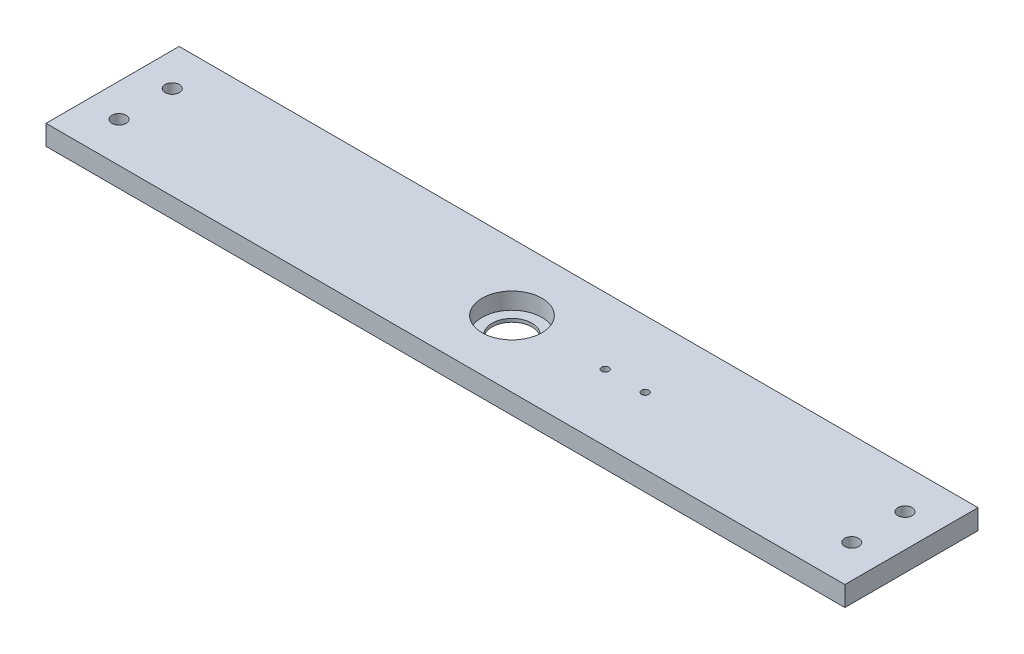
ISO-10303-21;
HEADER;
FILE_DESCRIPTION(('STEP AP214'),'2;1');
FILE_NAME('part.step','',(''),(''),'','','');
FILE_SCHEMA(('AUTOMOTIVE_DESIGN { 1 0 10303 214 1 1 1 1 }'));
ENDSEC;
DATA;
#1=APPLICATION_CONTEXT('core data for automotive mechanical design processes');
#2=APPLICATION_PROTOCOL_DEFINITION('international standard','automotive_design',2000,#1);
#3=PRODUCT_CONTEXT('',#1,'mechanical');
#4=PRODUCT('Part','Part','',(#3));
#5=PRODUCT_RELATED_PRODUCT_CATEGORY('part','',(#4));
#6=PRODUCT_DEFINITION_FORMATION('','',#4);
#7=PRODUCT_DEFINITION_CONTEXT('part definition',#1,'design');
#8=PRODUCT_DEFINITION('design','',#6,#7);
#9=PRODUCT_DEFINITION_SHAPE('','',#8);
#10=(LENGTH_UNIT() NAMED_UNIT(*) SI_UNIT(.MILLI.,.METRE.));
#11=(NAMED_UNIT(*) PLANE_ANGLE_UNIT() SI_UNIT($,.RADIAN.));
#12=(NAMED_UNIT(*) SI_UNIT($,.STERADIAN.) SOLID_ANGLE_UNIT());
#13=UNCERTAINTY_MEASURE_WITH_UNIT(LENGTH_MEASURE(1.E-05),#10,'distance_accuracy_value','');
#14=(GEOMETRIC_REPRESENTATION_CONTEXT(3) GLOBAL_UNCERTAINTY_ASSIGNED_CONTEXT((#13)) GLOBAL_UNIT_ASSIGNED_CONTEXT((#10,
#11,#12)) REPRESENTATION_CONTEXT('',''));
#15=CARTESIAN_POINT('',(0.,0.,0.));
#16=DIRECTION('',(0.,0.,1.));
#17=DIRECTION('',(1.,0.,0.));
#18=AXIS2_PLACEMENT_3D('',#15,#16,#17);
#19=CARTESIAN_POINT('',(190.5,9.525,31.75));
#20=DIRECTION('',(-1.,0.,0.));
#21=DIRECTION('',(0.,0.,1.));
#22=AXIS2_PLACEMENT_3D('',#19,#20,#21);
#23=PLANE('',#22);
#24=DIRECTION('',(0.,0.,-1.));
#25=VECTOR('',#24,1.);
#26=CARTESIAN_POINT('',(190.5,0.,31.75));
#27=LINE('',#26,#25);
#28=CARTESIAN_POINT('',(190.5,0.,31.75));
#29=VERTEX_POINT('',#28);
#30=CARTESIAN_POINT('',(190.5,0.,-31.75));
#31=VERTEX_POINT('',#30);
#32=EDGE_CURVE('E100',#29,#31,#27,.T.);
#33=ORIENTED_EDGE('',*,*,#32,.T.);
#34=DIRECTION('',(0.,-1.,0.));
#35=VECTOR('',#34,1.);
#36=CARTESIAN_POINT('',(190.5,9.525,-31.75));
#37=LINE('',#36,#35);
#38=CARTESIAN_POINT('',(190.5,9.525,-31.75));
#39=VERTEX_POINT('',#38);
#40=EDGE_CURVE('E11',#39,#31,#37,.T.);
#41=ORIENTED_EDGE('',*,*,#40,.F.);
#42=DIRECTION('',(0.,0.,-1.));
#43=VECTOR('',#42,1.);
#44=CARTESIAN_POINT('',(190.5,9.525,31.75));
#45=LINE('',#44,#43);
#46=CARTESIAN_POINT('',(190.5,9.525,31.75));
#47=VERTEX_POINT('',#46);
#48=EDGE_CURVE('E88',#47,#39,#45,.T.);
#49=ORIENTED_EDGE('',*,*,#48,.F.);
#50=DIRECTION('',(0.,-1.,0.));
#51=VECTOR('',#50,1.);
#52=CARTESIAN_POINT('',(190.5,9.525,31.75));
#53=LINE('',#52,#51);
#54=EDGE_CURVE('E96',#47,#29,#53,.T.);
#55=ORIENTED_EDGE('',*,*,#54,.T.);
#56=EDGE_LOOP('',(#33,#41,#49,#55));
#57=FACE_BOUND('',#56,.T.);
#58=ADVANCED_FACE('F37',(#57),#23,.F.);
#59=CARTESIAN_POINT('',(-190.5,9.525,-31.75));
#60=DIRECTION('',(0.,0.,1.));
#61=DIRECTION('',(1.,0.,0.));
#62=AXIS2_PLACEMENT_3D('',#59,#60,#61);
#63=PLANE('',#62);
#64=DIRECTION('',(-1.,0.,0.));
#65=VECTOR('',#64,1.);
#66=CARTESIAN_POINT('',(-190.5,0.,-31.75));
#67=LINE('',#66,#65);
#68=CARTESIAN_POINT('',(-190.5,0.,-31.75));
#69=VERTEX_POINT('',#68);
#70=EDGE_CURVE('E92',#31,#69,#67,.T.);
#71=ORIENTED_EDGE('',*,*,#70,.T.);
#72=DIRECTION('',(0.,-1.,0.));
#73=VECTOR('',#72,1.);
#74=CARTESIAN_POINT('',(-190.5,9.525,-31.75));
#75=LINE('',#74,#73);
#76=CARTESIAN_POINT('',(-190.5,9.525,-31.75));
#77=VERTEX_POINT('',#76);
#78=EDGE_CURVE('E45',#77,#69,#75,.T.);
#79=ORIENTED_EDGE('',*,*,#78,.F.);
#80=DIRECTION('',(-1.,0.,0.));
#81=VECTOR('',#80,1.);
#82=CARTESIAN_POINT('',(-190.5,9.525,-31.75));
#83=LINE('',#82,#81);
#84=EDGE_CURVE('E83',#39,#77,#83,.T.);
#85=ORIENTED_EDGE('',*,*,#84,.F.);
#86=ORIENTED_EDGE('',*,*,#40,.T.);
#87=EDGE_LOOP('',(#71,#79,#85,#86));
#88=FACE_BOUND('',#87,.T.);
#89=ADVANCED_FACE('F91',(#88),#63,.F.);
#90=CARTESIAN_POINT('',(-190.5,9.525,31.75));
#91=DIRECTION('',(1.,0.,0.));
#92=DIRECTION('',(0.,0.,-1.));
#93=AXIS2_PLACEMENT_3D('',#90,#91,#92);
#94=PLANE('',#93);
#95=DIRECTION('',(0.,0.,1.));
#96=VECTOR('',#95,1.);
#97=CARTESIAN_POINT('',(-190.5,0.,31.75));
#98=LINE('',#97,#96);
#99=CARTESIAN_POINT('',(-190.5,0.,31.75));
#100=VERTEX_POINT('',#99);
#101=EDGE_CURVE('E70',#69,#100,#98,.T.);
#102=ORIENTED_EDGE('',*,*,#101,.T.);
#103=DIRECTION('',(0.,-1.,0.));
#104=VECTOR('',#103,1.);
#105=CARTESIAN_POINT('',(-190.5,9.525,31.75));
#106=LINE('',#105,#104);
#107=CARTESIAN_POINT('',(-190.5,9.525,31.75));
#108=VERTEX_POINT('',#107);
#109=EDGE_CURVE('E93',#108,#100,#106,.T.);
#110=ORIENTED_EDGE('',*,*,#109,.F.);
#111=DIRECTION('',(0.,0.,1.));
#112=VECTOR('',#111,1.);
#113=CARTESIAN_POINT('',(-190.5,9.525,31.75));
#114=LINE('',#113,#112);
#115=EDGE_CURVE('E86',#77,#108,#114,.T.);
#116=ORIENTED_EDGE('',*,*,#115,.F.);
#117=ORIENTED_EDGE('',*,*,#78,.T.);
#118=EDGE_LOOP('',(#102,#110,#116,#117));
#119=FACE_BOUND('',#118,.T.);
#120=ADVANCED_FACE('F94',(#119),#94,.F.);
#121=CARTESIAN_POINT('',(-190.5,9.525,31.75));
#122=DIRECTION('',(0.,0.,-1.));
#123=DIRECTION('',(-1.,0.,0.));
#124=AXIS2_PLACEMENT_3D('',#121,#122,#123);
#125=PLANE('',#124);
#126=DIRECTION('',(1.,0.,0.));
#127=VECTOR('',#126,1.);
#128=CARTESIAN_POINT('',(-190.5,0.,31.75));
#129=LINE('',#128,#127);
#130=EDGE_CURVE('E76',#100,#29,#129,.T.);
#131=ORIENTED_EDGE('',*,*,#130,.T.);
#132=ORIENTED_EDGE('',*,*,#54,.F.);
#133=DIRECTION('',(1.,0.,0.));
#134=VECTOR('',#133,1.);
#135=CARTESIAN_POINT('',(-190.5,9.525,31.75));
#136=LINE('',#135,#134);
#137=EDGE_CURVE('E53',#108,#47,#136,.T.);
#138=ORIENTED_EDGE('',*,*,#137,.F.);
#139=ORIENTED_EDGE('',*,*,#109,.T.);
#140=EDGE_LOOP('',(#131,#132,#138,#139));
#141=FACE_BOUND('',#140,.T.);
#142=ADVANCED_FACE('F108',(#141),#125,.F.);
#143=CARTESIAN_POINT('',(190.5,9.525,-31.75));
#144=DIRECTION('',(0.,-1.,0.));
#145=DIRECTION('',(0.,0.,-1.));
#146=AXIS2_PLACEMENT_3D('',#143,#144,#145);
#147=PLANE('',#146);
#148=CARTESIAN_POINT('',(63.5,9.525,0.));
#149=DIRECTION('',(0.,1.,0.));
#150=DIRECTION('',(0.,0.,1.));
#151=AXIS2_PLACEMENT_3D('',#148,#149,#150);
#152=CIRCLE('',#151,1.7272);
#153=CARTESIAN_POINT('',(63.5,9.525,1.7272));
#154=VERTEX_POINT('',#153);
#155=EDGE_CURVE('E152',#154,#154,#152,.T.);
#156=ORIENTED_EDGE('',*,*,#155,.F.);
#157=EDGE_LOOP('',(#156));
#158=FACE_BOUND('',#157,.T.);
#159=CARTESIAN_POINT('',(44.45,9.525,0.));
#160=DIRECTION('',(0.,1.,0.));
#161=DIRECTION('',(0.,0.,1.));
#162=AXIS2_PLACEMENT_3D('',#159,#160,#161);
#163=CIRCLE('',#162,1.7272);
#164=CARTESIAN_POINT('',(44.45,9.525,1.7272));
#165=VERTEX_POINT('',#164);
#166=EDGE_CURVE('E146',#165,#165,#163,.T.);
#167=ORIENTED_EDGE('',*,*,#166,.F.);
#168=EDGE_LOOP('',(#167));
#169=FACE_BOUND('',#168,.T.);
#170=CARTESIAN_POINT('',(-174.738781321865,9.525,-12.7));
#171=DIRECTION('',(0.,1.,0.));
#172=DIRECTION('',(0.,0.,1.));
#173=AXIS2_PLACEMENT_3D('',#170,#171,#172);
#174=CIRCLE('',#173,3.3782);
#175=CARTESIAN_POINT('',(-174.738781321865,9.525,-9.32180000000001));
#176=VERTEX_POINT('',#175);
#177=EDGE_CURVE('E140',#176,#176,#174,.T.);
#178=ORIENTED_EDGE('',*,*,#177,.F.);
#179=EDGE_LOOP('',(#178));
#180=FACE_BOUND('',#179,.T.);
#181=CARTESIAN_POINT('',(174.738781321866,9.525,-12.7));
#182=DIRECTION('',(0.,1.,0.));
#183=DIRECTION('',(0.,0.,1.));
#184=AXIS2_PLACEMENT_3D('',#181,#182,#183);
#185=CIRCLE('',#184,3.3782);
#186=CARTESIAN_POINT('',(174.738781321866,9.525,-9.32180000000001));
#187=VERTEX_POINT('',#186);
#188=EDGE_CURVE('E134',#187,#187,#185,.T.);
#189=ORIENTED_EDGE('',*,*,#188,.F.);
#190=EDGE_LOOP('',(#189));
#191=FACE_BOUND('',#190,.T.);
#192=CARTESIAN_POINT('',(-174.738781321865,9.525,12.7));
#193=DIRECTION('',(0.,1.,0.));
#194=DIRECTION('',(0.,0.,1.));
#195=AXIS2_PLACEMENT_3D('',#192,#193,#194);
#196=CIRCLE('',#195,3.3782);
#197=CARTESIAN_POINT('',(-174.738781321865,9.525,16.0782));
#198=VERTEX_POINT('',#197);
#199=EDGE_CURVE('E128',#198,#198,#196,.T.);
#200=ORIENTED_EDGE('',*,*,#199,.F.);
#201=EDGE_LOOP('',(#200));
#202=FACE_BOUND('',#201,.T.);
#203=CARTESIAN_POINT('',(174.738781321866,9.525,12.7));
#204=DIRECTION('',(0.,1.,0.));
#205=DIRECTION('',(0.,0.,1.));
#206=AXIS2_PLACEMENT_3D('',#203,#204,#205);
#207=CIRCLE('',#206,3.3782);
#208=CARTESIAN_POINT('',(174.738781321866,9.525,16.0782));
#209=VERTEX_POINT('',#208);
#210=EDGE_CURVE('E122',#209,#209,#207,.T.);
#211=ORIENTED_EDGE('',*,*,#210,.F.);
#212=EDGE_LOOP('',(#211));
#213=FACE_BOUND('',#212,.T.);
#214=CARTESIAN_POINT('',(0.,9.525,0.));
#215=DIRECTION('',(0.,1.,0.));
#216=DIRECTION('',(0.,0.,1.));
#217=AXIS2_PLACEMENT_3D('',#214,#215,#216);
#218=CIRCLE('',#217,14.2875);
#219=CARTESIAN_POINT('',(0.,9.525,14.2875));
#220=VERTEX_POINT('',#219);
#221=EDGE_CURVE('E114',#220,#220,#218,.T.);
#222=ORIENTED_EDGE('',*,*,#221,.F.);
#223=EDGE_LOOP('',(#222));
#224=FACE_BOUND('',#223,.T.);
#225=ORIENTED_EDGE('',*,*,#48,.T.);
#226=ORIENTED_EDGE('',*,*,#84,.T.);
#227=ORIENTED_EDGE('',*,*,#115,.T.);
#228=ORIENTED_EDGE('',*,*,#137,.T.);
#229=EDGE_LOOP('',(#225,#226,#227,#228));
#230=FACE_BOUND('',#229,.T.);
#231=ADVANCED_FACE('F84',(#158,#169,#180,#191,#202,#213,#224,#230),#147,.F.);
#232=CARTESIAN_POINT('',(190.5,0.,-31.75));
#233=DIRECTION('',(0.,-1.,0.));
#234=DIRECTION('',(0.,0.,-1.));
#235=AXIS2_PLACEMENT_3D('',#232,#233,#234);
#236=PLANE('',#235);
#237=CARTESIAN_POINT('',(0.,0.,0.));
#238=DIRECTION('',(0.,1.,0.));
#239=DIRECTION('',(0.,0.,1.));
#240=AXIS2_PLACEMENT_3D('',#237,#238,#239);
#241=CIRCLE('',#240,9.525);
#242=CARTESIAN_POINT('',(0.,0.,9.525));
#243=VERTEX_POINT('',#242);
#244=EDGE_CURVE('E155',#243,#243,#241,.T.);
#245=ORIENTED_EDGE('',*,*,#244,.T.);
#246=EDGE_LOOP('',(#245));
#247=FACE_BOUND('',#246,.T.);
#248=CARTESIAN_POINT('',(63.5,0.,0.));
#249=DIRECTION('',(0.,1.,0.));
#250=DIRECTION('',(0.,0.,1.));
#251=AXIS2_PLACEMENT_3D('',#248,#249,#250);
#252=CIRCLE('',#251,1.7272);
#253=CARTESIAN_POINT('',(63.5,0.,1.7272));
#254=VERTEX_POINT('',#253);
#255=EDGE_CURVE('E149',#254,#254,#252,.T.);
#256=ORIENTED_EDGE('',*,*,#255,.T.);
#257=EDGE_LOOP('',(#256));
#258=FACE_BOUND('',#257,.T.);
#259=CARTESIAN_POINT('',(44.45,0.,0.));
#260=DIRECTION('',(0.,1.,0.));
#261=DIRECTION('',(0.,0.,1.));
#262=AXIS2_PLACEMENT_3D('',#259,#260,#261);
#263=CIRCLE('',#262,1.7272);
#264=CARTESIAN_POINT('',(44.45,0.,1.7272));
#265=VERTEX_POINT('',#264);
#266=EDGE_CURVE('E143',#265,#265,#263,.T.);
#267=ORIENTED_EDGE('',*,*,#266,.T.);
#268=EDGE_LOOP('',(#267));
#269=FACE_BOUND('',#268,.T.);
#270=CARTESIAN_POINT('',(-174.738781321865,0.,-12.7));
#271=DIRECTION('',(0.,1.,0.));
#272=DIRECTION('',(0.,0.,1.));
#273=AXIS2_PLACEMENT_3D('',#270,#271,#272);
#274=CIRCLE('',#273,3.3782);
#275=CARTESIAN_POINT('',(-174.738781321865,0.,-9.32180000000001));
#276=VERTEX_POINT('',#275);
#277=EDGE_CURVE('E137',#276,#276,#274,.T.);
#278=ORIENTED_EDGE('',*,*,#277,.T.);
#279=EDGE_LOOP('',(#278));
#280=FACE_BOUND('',#279,.T.);
#281=CARTESIAN_POINT('',(174.738781321866,0.,-12.7));
#282=DIRECTION('',(0.,1.,0.));
#283=DIRECTION('',(0.,0.,1.));
#284=AXIS2_PLACEMENT_3D('',#281,#282,#283);
#285=CIRCLE('',#284,3.3782);
#286=CARTESIAN_POINT('',(174.738781321866,0.,-9.32180000000001));
#287=VERTEX_POINT('',#286);
#288=EDGE_CURVE('E131',#287,#287,#285,.T.);
#289=ORIENTED_EDGE('',*,*,#288,.T.);
#290=EDGE_LOOP('',(#289));
#291=FACE_BOUND('',#290,.T.);
#292=CARTESIAN_POINT('',(-174.738781321865,0.,12.7));
#293=DIRECTION('',(0.,1.,0.));
#294=DIRECTION('',(0.,0.,1.));
#295=AXIS2_PLACEMENT_3D('',#292,#293,#294);
#296=CIRCLE('',#295,3.3782);
#297=CARTESIAN_POINT('',(-174.738781321865,0.,16.0782));
#298=VERTEX_POINT('',#297);
#299=EDGE_CURVE('E125',#298,#298,#296,.T.);
#300=ORIENTED_EDGE('',*,*,#299,.T.);
#301=EDGE_LOOP('',(#300));
#302=FACE_BOUND('',#301,.T.);
#303=CARTESIAN_POINT('',(174.738781321866,0.,12.7));
#304=DIRECTION('',(0.,1.,0.));
#305=DIRECTION('',(0.,0.,1.));
#306=AXIS2_PLACEMENT_3D('',#303,#304,#305);
#307=CIRCLE('',#306,3.3782);
#308=CARTESIAN_POINT('',(174.738781321866,0.,16.0782));
#309=VERTEX_POINT('',#308);
#310=EDGE_CURVE('E117',#309,#309,#307,.T.);
#311=ORIENTED_EDGE('',*,*,#310,.T.);
#312=EDGE_LOOP('',(#311));
#313=FACE_BOUND('',#312,.T.);
#314=ORIENTED_EDGE('',*,*,#32,.F.);
#315=ORIENTED_EDGE('',*,*,#130,.F.);
#316=ORIENTED_EDGE('',*,*,#101,.F.);
#317=ORIENTED_EDGE('',*,*,#70,.F.);
#318=EDGE_LOOP('',(#314,#315,#316,#317));
#319=FACE_BOUND('',#318,.T.);
#320=ADVANCED_FACE('F111',(#247,#258,#269,#280,#291,#302,#313,#319),#236,.T.);
#321=CARTESIAN_POINT('',(0.,1.5875,0.));
#322=DIRECTION('',(0.,1.,0.));
#323=DIRECTION('',(0.,0.,1.));
#324=AXIS2_PLACEMENT_3D('',#321,#322,#323);
#325=CYLINDRICAL_SURFACE('',#324,14.2875);
#326=CARTESIAN_POINT('',(0.,1.5875,0.));
#327=DIRECTION('',(0.,1.,0.));
#328=DIRECTION('',(0.,0.,1.));
#329=AXIS2_PLACEMENT_3D('',#326,#327,#328);
#330=CIRCLE('',#329,14.2875);
#331=CARTESIAN_POINT('',(0.,1.5875,14.2875));
#332=VERTEX_POINT('',#331);
#333=EDGE_CURVE('E103',#332,#332,#330,.T.);
#334=ORIENTED_EDGE('',*,*,#333,.F.);
#335=EDGE_LOOP('',(#334));
#336=FACE_BOUND('',#335,.T.);
#337=ORIENTED_EDGE('',*,*,#221,.T.);
#338=EDGE_LOOP('',(#337));
#339=FACE_BOUND('',#338,.T.);
#340=ADVANCED_FACE('F175',(#336,#339),#325,.F.);
#341=CARTESIAN_POINT('',(0.,1.5875,0.));
#342=DIRECTION('',(0.,1.,0.));
#343=DIRECTION('',(0.,0.,1.));
#344=AXIS2_PLACEMENT_3D('',#341,#342,#343);
#345=PLANE('',#344);
#346=CARTESIAN_POINT('',(0.,1.5875,0.));
#347=DIRECTION('',(0.,1.,0.));
#348=DIRECTION('',(0.,0.,1.));
#349=AXIS2_PLACEMENT_3D('',#346,#347,#348);
#350=CIRCLE('',#349,9.525);
#351=CARTESIAN_POINT('',(0.,1.5875,9.525));
#352=VERTEX_POINT('',#351);
#353=EDGE_CURVE('E156',#352,#352,#350,.T.);
#354=ORIENTED_EDGE('',*,*,#353,.F.);
#355=EDGE_LOOP('',(#354));
#356=FACE_BOUND('',#355,.T.);
#357=ORIENTED_EDGE('',*,*,#333,.T.);
#358=EDGE_LOOP('',(#357));
#359=FACE_BOUND('',#358,.T.);
#360=ADVANCED_FACE('F171',(#356,#359),#345,.T.);
#361=CARTESIAN_POINT('',(174.738781321866,9.525,12.7));
#362=DIRECTION('',(0.,1.,0.));
#363=DIRECTION('',(0.,0.,1.));
#364=AXIS2_PLACEMENT_3D('',#361,#362,#363);
#365=CYLINDRICAL_SURFACE('',#364,3.3782);
#366=ORIENTED_EDGE('',*,*,#310,.F.);
#367=EDGE_LOOP('',(#366));
#368=FACE_BOUND('',#367,.T.);
#369=ORIENTED_EDGE('',*,*,#210,.T.);
#370=EDGE_LOOP('',(#369));
#371=FACE_BOUND('',#370,.T.);
#372=ADVANCED_FACE('F174',(#368,#371),#365,.F.);
#373=CARTESIAN_POINT('',(-174.738781321865,9.525,12.7));
#374=DIRECTION('',(0.,1.,0.));
#375=DIRECTION('',(0.,0.,1.));
#376=AXIS2_PLACEMENT_3D('',#373,#374,#375);
#377=CYLINDRICAL_SURFACE('',#376,3.3782);
#378=ORIENTED_EDGE('',*,*,#299,.F.);
#379=EDGE_LOOP('',(#378));
#380=FACE_BOUND('',#379,.T.);
#381=ORIENTED_EDGE('',*,*,#199,.T.);
#382=EDGE_LOOP('',(#381));
#383=FACE_BOUND('',#382,.T.);
#384=ADVANCED_FACE('F227',(#380,#383),#377,.F.);
#385=CARTESIAN_POINT('',(174.738781321866,9.525,-12.7));
#386=DIRECTION('',(0.,1.,0.));
#387=DIRECTION('',(0.,0.,1.));
#388=AXIS2_PLACEMENT_3D('',#385,#386,#387);
#389=CYLINDRICAL_SURFACE('',#388,3.3782);
#390=ORIENTED_EDGE('',*,*,#288,.F.);
#391=EDGE_LOOP('',(#390));
#392=FACE_BOUND('',#391,.T.);
#393=ORIENTED_EDGE('',*,*,#188,.T.);
#394=EDGE_LOOP('',(#393));
#395=FACE_BOUND('',#394,.T.);
#396=ADVANCED_FACE('F237',(#392,#395),#389,.F.);
#397=CARTESIAN_POINT('',(-174.738781321865,9.525,-12.7));
#398=DIRECTION('',(0.,1.,0.));
#399=DIRECTION('',(0.,0.,1.));
#400=AXIS2_PLACEMENT_3D('',#397,#398,#399);
#401=CYLINDRICAL_SURFACE('',#400,3.3782);
#402=ORIENTED_EDGE('',*,*,#277,.F.);
#403=EDGE_LOOP('',(#402));
#404=FACE_BOUND('',#403,.T.);
#405=ORIENTED_EDGE('',*,*,#177,.T.);
#406=EDGE_LOOP('',(#405));
#407=FACE_BOUND('',#406,.T.);
#408=ADVANCED_FACE('F247',(#404,#407),#401,.F.);
#409=CARTESIAN_POINT('',(44.45,9.525,0.));
#410=DIRECTION('',(0.,1.,0.));
#411=DIRECTION('',(0.,0.,1.));
#412=AXIS2_PLACEMENT_3D('',#409,#410,#411);
#413=CYLINDRICAL_SURFACE('',#412,1.7272);
#414=ORIENTED_EDGE('',*,*,#266,.F.);
#415=EDGE_LOOP('',(#414));
#416=FACE_BOUND('',#415,.T.);
#417=ORIENTED_EDGE('',*,*,#166,.T.);
#418=EDGE_LOOP('',(#417));
#419=FACE_BOUND('',#418,.T.);
#420=ADVANCED_FACE('F256',(#416,#419),#413,.F.);
#421=CARTESIAN_POINT('',(63.5,9.525,0.));
#422=DIRECTION('',(0.,1.,0.));
#423=DIRECTION('',(0.,0.,1.));
#424=AXIS2_PLACEMENT_3D('',#421,#422,#423);
#425=CYLINDRICAL_SURFACE('',#424,1.7272);
#426=ORIENTED_EDGE('',*,*,#255,.F.);
#427=EDGE_LOOP('',(#426));
#428=FACE_BOUND('',#427,.T.);
#429=ORIENTED_EDGE('',*,*,#155,.T.);
#430=EDGE_LOOP('',(#429));
#431=FACE_BOUND('',#430,.T.);
#432=ADVANCED_FACE('F167',(#428,#431),#425,.F.);
#433=CARTESIAN_POINT('',(0.,0.,0.));
#434=DIRECTION('',(0.,1.,0.));
#435=DIRECTION('',(0.,0.,1.));
#436=AXIS2_PLACEMENT_3D('',#433,#434,#435);
#437=CYLINDRICAL_SURFACE('',#436,9.525);
#438=ORIENTED_EDGE('',*,*,#244,.F.);
#439=EDGE_LOOP('',(#438));
#440=FACE_BOUND('',#439,.T.);
#441=ORIENTED_EDGE('',*,*,#353,.T.);
#442=EDGE_LOOP('',(#441));
#443=FACE_BOUND('',#442,.T.);
#444=ADVANCED_FACE('F164',(#440,#443),#437,.F.);
#445=CLOSED_SHELL('',(#58,#89,#120,#142,#231,#320,#340,#360,#372,#384,#396,#408,#420,#432,#444));
#446=MANIFOLD_SOLID_BREP('B2',#445);
#447=ADVANCED_BREP_SHAPE_REPRESENTATION('',(#18,#446),#14);
#448=SHAPE_DEFINITION_REPRESENTATION(#9,#447);
ENDSEC;
END-ISO-10303-21;
